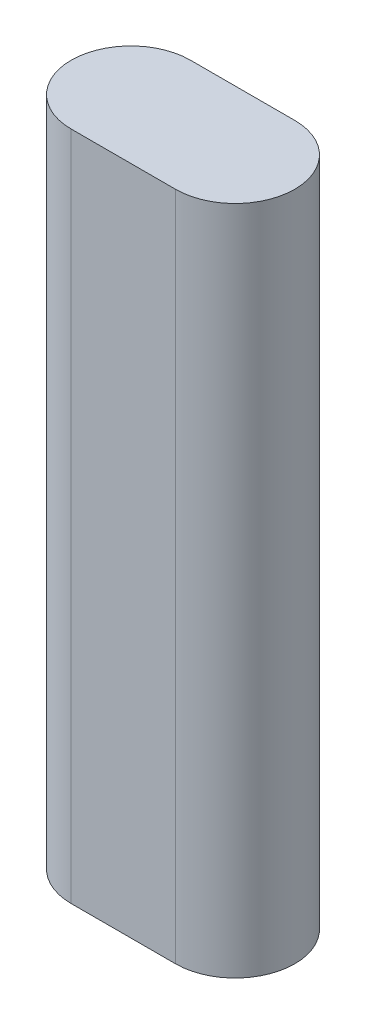
ISO-10303-21;
HEADER;
FILE_DESCRIPTION(('STEP AP214'),'2;1');
FILE_NAME('part.step','',(''),(''),'','','');
FILE_SCHEMA(('AUTOMOTIVE_DESIGN { 1 0 10303 214 1 1 1 1 }'));
ENDSEC;
DATA;
#1=APPLICATION_CONTEXT('core data for automotive mechanical design processes');
#2=APPLICATION_PROTOCOL_DEFINITION('international standard','automotive_design',2000,#1);
#3=PRODUCT_CONTEXT('',#1,'mechanical');
#4=PRODUCT('Part','Part','',(#3));
#5=PRODUCT_RELATED_PRODUCT_CATEGORY('part','',(#4));
#6=PRODUCT_DEFINITION_FORMATION('','',#4);
#7=PRODUCT_DEFINITION_CONTEXT('part definition',#1,'design');
#8=PRODUCT_DEFINITION('design','',#6,#7);
#9=PRODUCT_DEFINITION_SHAPE('','',#8);
#10=(LENGTH_UNIT() NAMED_UNIT(*) SI_UNIT(.MILLI.,.METRE.));
#11=(NAMED_UNIT(*) PLANE_ANGLE_UNIT() SI_UNIT($,.RADIAN.));
#12=(NAMED_UNIT(*) SI_UNIT($,.STERADIAN.) SOLID_ANGLE_UNIT());
#13=UNCERTAINTY_MEASURE_WITH_UNIT(LENGTH_MEASURE(1.E-05),#10,'distance_accuracy_value','');
#14=(GEOMETRIC_REPRESENTATION_CONTEXT(3) GLOBAL_UNCERTAINTY_ASSIGNED_CONTEXT((#13)) GLOBAL_UNIT_ASSIGNED_CONTEXT((#10,
#11,#12)) REPRESENTATION_CONTEXT('',''));
#15=CARTESIAN_POINT('',(0.,0.,0.));
#16=DIRECTION('',(0.,0.,1.));
#17=DIRECTION('',(1.,0.,0.));
#18=AXIS2_PLACEMENT_3D('',#15,#16,#17);
#19=CARTESIAN_POINT('',(-10.5,135.,0.));
#20=DIRECTION('',(0.,-1.,0.));
#21=DIRECTION('',(0.,0.,-1.));
#22=AXIS2_PLACEMENT_3D('',#19,#20,#21);
#23=CYLINDRICAL_SURFACE('',#22,12.);
#24=CARTESIAN_POINT('',(-10.5,0.,0.));
#25=DIRECTION('',(0.,1.,0.));
#26=DIRECTION('',(0.,0.,1.));
#27=AXIS2_PLACEMENT_3D('',#24,#25,#26);
#28=CIRCLE('',#27,12.);
#29=CARTESIAN_POINT('',(-10.5,0.,-12.));
#30=VERTEX_POINT('',#29);
#31=CARTESIAN_POINT('',(-10.5,0.,12.));
#32=VERTEX_POINT('',#31);
#33=EDGE_CURVE('E93',#30,#32,#28,.T.);
#34=ORIENTED_EDGE('',*,*,#33,.T.);
#35=DIRECTION('',(0.,-1.,0.));
#36=VECTOR('',#35,1.);
#37=CARTESIAN_POINT('',(-10.5,135.,12.));
#38=LINE('',#37,#36);
#39=CARTESIAN_POINT('',(-10.5,135.,12.));
#40=VERTEX_POINT('',#39);
#41=EDGE_CURVE('E11',#40,#32,#38,.T.);
#42=ORIENTED_EDGE('',*,*,#41,.F.);
#43=CARTESIAN_POINT('',(-10.5,135.,0.));
#44=DIRECTION('',(0.,1.,0.));
#45=DIRECTION('',(0.,0.,1.));
#46=AXIS2_PLACEMENT_3D('',#43,#44,#45);
#47=CIRCLE('',#46,12.);
#48=CARTESIAN_POINT('',(-10.5,135.,-12.));
#49=VERTEX_POINT('',#48);
#50=EDGE_CURVE('E81',#49,#40,#47,.T.);
#51=ORIENTED_EDGE('',*,*,#50,.F.);
#52=DIRECTION('',(0.,-1.,0.));
#53=VECTOR('',#52,1.);
#54=CARTESIAN_POINT('',(-10.5,135.,-12.));
#55=LINE('',#54,#53);
#56=EDGE_CURVE('E89',#49,#30,#55,.T.);
#57=ORIENTED_EDGE('',*,*,#56,.T.);
#58=EDGE_LOOP('',(#34,#42,#51,#57));
#59=FACE_BOUND('',#58,.T.);
#60=ADVANCED_FACE('F30',(#59),#23,.T.);
#61=CARTESIAN_POINT('',(-10.5,135.,12.));
#62=DIRECTION('',(0.,0.,-1.));
#63=DIRECTION('',(-1.,0.,0.));
#64=AXIS2_PLACEMENT_3D('',#61,#62,#63);
#65=PLANE('',#64);
#66=DIRECTION('',(1.,0.,0.));
#67=VECTOR('',#66,1.);
#68=CARTESIAN_POINT('',(-10.5,0.,12.));
#69=LINE('',#68,#67);
#70=CARTESIAN_POINT('',(10.5,0.,12.));
#71=VERTEX_POINT('',#70);
#72=EDGE_CURVE('E85',#32,#71,#69,.T.);
#73=ORIENTED_EDGE('',*,*,#72,.T.);
#74=DIRECTION('',(0.,-1.,0.));
#75=VECTOR('',#74,1.);
#76=CARTESIAN_POINT('',(10.5,135.,12.));
#77=LINE('',#76,#75);
#78=CARTESIAN_POINT('',(10.5,135.,12.));
#79=VERTEX_POINT('',#78);
#80=EDGE_CURVE('E38',#79,#71,#77,.T.);
#81=ORIENTED_EDGE('',*,*,#80,.F.);
#82=DIRECTION('',(1.,0.,0.));
#83=VECTOR('',#82,1.);
#84=CARTESIAN_POINT('',(-10.5,135.,12.));
#85=LINE('',#84,#83);
#86=EDGE_CURVE('E76',#40,#79,#85,.T.);
#87=ORIENTED_EDGE('',*,*,#86,.F.);
#88=ORIENTED_EDGE('',*,*,#41,.T.);
#89=EDGE_LOOP('',(#73,#81,#87,#88));
#90=FACE_BOUND('',#89,.T.);
#91=ADVANCED_FACE('F84',(#90),#65,.F.);
#92=CARTESIAN_POINT('',(10.5,135.,0.));
#93=DIRECTION('',(0.,-1.,0.));
#94=DIRECTION('',(0.,0.,-1.));
#95=AXIS2_PLACEMENT_3D('',#92,#93,#94);
#96=CYLINDRICAL_SURFACE('',#95,12.);
#97=CARTESIAN_POINT('',(10.5,0.,0.));
#98=DIRECTION('',(0.,1.,0.));
#99=DIRECTION('',(0.,0.,1.));
#100=AXIS2_PLACEMENT_3D('',#97,#98,#99);
#101=CIRCLE('',#100,12.);
#102=CARTESIAN_POINT('',(10.5,0.,-12.));
#103=VERTEX_POINT('',#102);
#104=EDGE_CURVE('E63',#71,#103,#101,.T.);
#105=ORIENTED_EDGE('',*,*,#104,.T.);
#106=DIRECTION('',(0.,-1.,0.));
#107=VECTOR('',#106,1.);
#108=CARTESIAN_POINT('',(10.5,135.,-12.));
#109=LINE('',#108,#107);
#110=CARTESIAN_POINT('',(10.5,135.,-12.));
#111=VERTEX_POINT('',#110);
#112=EDGE_CURVE('E86',#111,#103,#109,.T.);
#113=ORIENTED_EDGE('',*,*,#112,.F.);
#114=CARTESIAN_POINT('',(10.5,135.,0.));
#115=DIRECTION('',(0.,1.,0.));
#116=DIRECTION('',(0.,0.,1.));
#117=AXIS2_PLACEMENT_3D('',#114,#115,#116);
#118=CIRCLE('',#117,12.);
#119=EDGE_CURVE('E79',#79,#111,#118,.T.);
#120=ORIENTED_EDGE('',*,*,#119,.F.);
#121=ORIENTED_EDGE('',*,*,#80,.T.);
#122=EDGE_LOOP('',(#105,#113,#120,#121));
#123=FACE_BOUND('',#122,.T.);
#124=ADVANCED_FACE('F87',(#123),#96,.T.);
#125=CARTESIAN_POINT('',(-10.5,135.,-12.));
#126=DIRECTION('',(0.,0.,1.));
#127=DIRECTION('',(1.,0.,0.));
#128=AXIS2_PLACEMENT_3D('',#125,#126,#127);
#129=PLANE('',#128);
#130=DIRECTION('',(-1.,0.,0.));
#131=VECTOR('',#130,1.);
#132=CARTESIAN_POINT('',(-10.5,0.,-12.));
#133=LINE('',#132,#131);
#134=EDGE_CURVE('E69',#103,#30,#133,.T.);
#135=ORIENTED_EDGE('',*,*,#134,.T.);
#136=ORIENTED_EDGE('',*,*,#56,.F.);
#137=DIRECTION('',(-1.,0.,0.));
#138=VECTOR('',#137,1.);
#139=CARTESIAN_POINT('',(-10.5,135.,-12.));
#140=LINE('',#139,#138);
#141=EDGE_CURVE('E46',#111,#49,#140,.T.);
#142=ORIENTED_EDGE('',*,*,#141,.F.);
#143=ORIENTED_EDGE('',*,*,#112,.T.);
#144=EDGE_LOOP('',(#135,#136,#142,#143));
#145=FACE_BOUND('',#144,.T.);
#146=ADVANCED_FACE('F100',(#145),#129,.F.);
#147=CARTESIAN_POINT('',(-10.5,135.,0.));
#148=DIRECTION('',(0.,1.,0.));
#149=DIRECTION('',(0.,0.,1.));
#150=AXIS2_PLACEMENT_3D('',#147,#148,#149);
#151=PLANE('',#150);
#152=ORIENTED_EDGE('',*,*,#50,.T.);
#153=ORIENTED_EDGE('',*,*,#86,.T.);
#154=ORIENTED_EDGE('',*,*,#119,.T.);
#155=ORIENTED_EDGE('',*,*,#141,.T.);
#156=EDGE_LOOP('',(#152,#153,#154,#155));
#157=FACE_BOUND('',#156,.T.);
#158=ADVANCED_FACE('F77',(#157),#151,.T.);
#159=CARTESIAN_POINT('',(-10.5,0.,0.));
#160=DIRECTION('',(0.,1.,0.));
#161=DIRECTION('',(0.,0.,1.));
#162=AXIS2_PLACEMENT_3D('',#159,#160,#161);
#163=PLANE('',#162);
#164=ORIENTED_EDGE('',*,*,#33,.F.);
#165=ORIENTED_EDGE('',*,*,#134,.F.);
#166=ORIENTED_EDGE('',*,*,#104,.F.);
#167=ORIENTED_EDGE('',*,*,#72,.F.);
#168=EDGE_LOOP('',(#164,#165,#166,#167));
#169=FACE_BOUND('',#168,.T.);
#170=ADVANCED_FACE('F103',(#169),#163,.F.);
#171=CLOSED_SHELL('',(#60,#91,#124,#146,#158,#170));
#172=MANIFOLD_SOLID_BREP('B2',#171);
#173=ADVANCED_BREP_SHAPE_REPRESENTATION('',(#18,#172),#14);
#174=SHAPE_DEFINITION_REPRESENTATION(#9,#173);
ENDSEC;
END-ISO-10303-21;
